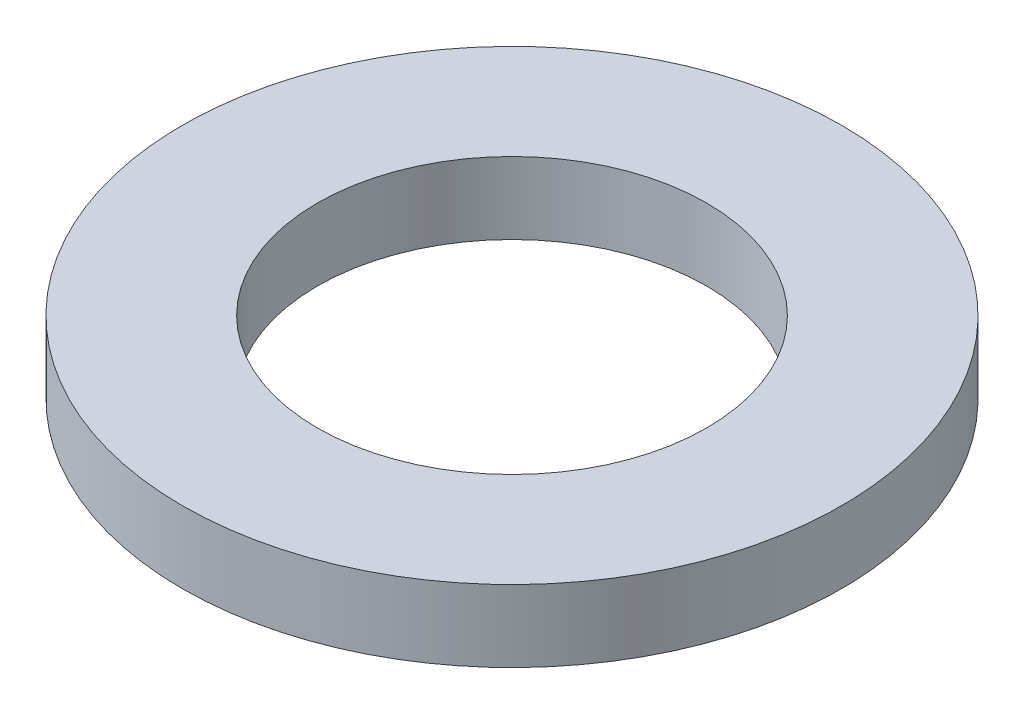
ISO-10303-21;
HEADER;
FILE_DESCRIPTION(('STEP AP214'),'2;1');
FILE_NAME('part.step','',(''),(''),'','','');
FILE_SCHEMA(('AUTOMOTIVE_DESIGN { 1 0 10303 214 1 1 1 1 }'));
ENDSEC;
DATA;
#1=APPLICATION_CONTEXT('core data for automotive mechanical design processes');
#2=APPLICATION_PROTOCOL_DEFINITION('international standard','automotive_design',2000,#1);
#3=PRODUCT_CONTEXT('',#1,'mechanical');
#4=PRODUCT('Part','Part','',(#3));
#5=PRODUCT_RELATED_PRODUCT_CATEGORY('part','',(#4));
#6=PRODUCT_DEFINITION_FORMATION('','',#4);
#7=PRODUCT_DEFINITION_CONTEXT('part definition',#1,'design');
#8=PRODUCT_DEFINITION('design','',#6,#7);
#9=PRODUCT_DEFINITION_SHAPE('','',#8);
#10=(LENGTH_UNIT() NAMED_UNIT(*) SI_UNIT(.MILLI.,.METRE.));
#11=(NAMED_UNIT(*) PLANE_ANGLE_UNIT() SI_UNIT($,.RADIAN.));
#12=(NAMED_UNIT(*) SI_UNIT($,.STERADIAN.) SOLID_ANGLE_UNIT());
#13=UNCERTAINTY_MEASURE_WITH_UNIT(LENGTH_MEASURE(1.E-05),#10,'distance_accuracy_value','');
#14=(GEOMETRIC_REPRESENTATION_CONTEXT(3) GLOBAL_UNCERTAINTY_ASSIGNED_CONTEXT((#13)) GLOBAL_UNIT_ASSIGNED_CONTEXT((#10,
#11,#12)) REPRESENTATION_CONTEXT('',''));
#15=CARTESIAN_POINT('',(0.,0.,0.));
#16=DIRECTION('',(0.,0.,1.));
#17=DIRECTION('',(1.,0.,0.));
#18=AXIS2_PLACEMENT_3D('',#15,#16,#17);
#19=CARTESIAN_POINT('',(0.,12.,0.));
#20=DIRECTION('',(0.,-1.,0.));
#21=DIRECTION('',(0.,0.,-1.));
#22=AXIS2_PLACEMENT_3D('',#19,#20,#21);
#23=CYLINDRICAL_SURFACE('',#22,55.);
#24=CARTESIAN_POINT('',(0.,12.,0.));
#25=DIRECTION('',(0.,1.,0.));
#26=DIRECTION('',(0.,0.,1.));
#27=AXIS2_PLACEMENT_3D('',#24,#25,#26);
#28=CIRCLE('',#27,55.);
#29=CARTESIAN_POINT('',(0.,12.,55.));
#30=VERTEX_POINT('',#29);
#31=EDGE_CURVE('E10',#30,#30,#28,.T.);
#32=ORIENTED_EDGE('',*,*,#31,.F.);
#33=EDGE_LOOP('',(#32));
#34=FACE_BOUND('',#33,.T.);
#35=CARTESIAN_POINT('',(0.,0.,0.));
#36=DIRECTION('',(0.,1.,0.));
#37=DIRECTION('',(0.,0.,1.));
#38=AXIS2_PLACEMENT_3D('',#35,#36,#37);
#39=CIRCLE('',#38,55.);
#40=CARTESIAN_POINT('',(0.,0.,55.));
#41=VERTEX_POINT('',#40);
#42=EDGE_CURVE('E37',#41,#41,#39,.T.);
#43=ORIENTED_EDGE('',*,*,#42,.T.);
#44=EDGE_LOOP('',(#43));
#45=FACE_BOUND('',#44,.T.);
#46=ADVANCED_FACE('F40',(#34,#45),#23,.T.);
#47=CARTESIAN_POINT('',(0.,12.,0.));
#48=DIRECTION('',(0.,1.,0.));
#49=DIRECTION('',(0.,0.,1.));
#50=AXIS2_PLACEMENT_3D('',#47,#48,#49);
#51=PLANE('',#50);
#52=CARTESIAN_POINT('',(0.,12.,0.));
#53=DIRECTION('',(0.,1.,0.));
#54=DIRECTION('',(0.,0.,1.));
#55=AXIS2_PLACEMENT_3D('',#52,#53,#54);
#56=CIRCLE('',#55,32.5);
#57=CARTESIAN_POINT('',(0.,12.,32.5));
#58=VERTEX_POINT('',#57);
#59=EDGE_CURVE('E50',#58,#58,#56,.T.);
#60=ORIENTED_EDGE('',*,*,#59,.F.);
#61=EDGE_LOOP('',(#60));
#62=FACE_BOUND('',#61,.T.);
#63=ORIENTED_EDGE('',*,*,#31,.T.);
#64=EDGE_LOOP('',(#63));
#65=FACE_BOUND('',#64,.T.);
#66=ADVANCED_FACE('F59',(#62,#65),#51,.T.);
#67=CARTESIAN_POINT('',(0.,0.,0.));
#68=DIRECTION('',(0.,1.,0.));
#69=DIRECTION('',(0.,0.,1.));
#70=AXIS2_PLACEMENT_3D('',#67,#68,#69);
#71=PLANE('',#70);
#72=CARTESIAN_POINT('',(0.,0.,0.));
#73=DIRECTION('',(0.,1.,0.));
#74=DIRECTION('',(0.,0.,1.));
#75=AXIS2_PLACEMENT_3D('',#72,#73,#74);
#76=CIRCLE('',#75,32.5);
#77=CARTESIAN_POINT('',(0.,0.,32.5));
#78=VERTEX_POINT('',#77);
#79=EDGE_CURVE('E47',#78,#78,#76,.T.);
#80=ORIENTED_EDGE('',*,*,#79,.T.);
#81=EDGE_LOOP('',(#80));
#82=FACE_BOUND('',#81,.T.);
#83=ORIENTED_EDGE('',*,*,#42,.F.);
#84=EDGE_LOOP('',(#83));
#85=FACE_BOUND('',#84,.T.);
#86=ADVANCED_FACE('F58',(#82,#85),#71,.F.);
#87=CARTESIAN_POINT('',(0.,12.,0.));
#88=DIRECTION('',(0.,-1.,0.));
#89=DIRECTION('',(0.,0.,-1.));
#90=AXIS2_PLACEMENT_3D('',#87,#88,#89);
#91=CYLINDRICAL_SURFACE('',#90,32.5);
#92=ORIENTED_EDGE('',*,*,#59,.T.);
#93=EDGE_LOOP('',(#92));
#94=FACE_BOUND('',#93,.T.);
#95=ORIENTED_EDGE('',*,*,#79,.F.);
#96=EDGE_LOOP('',(#95));
#97=FACE_BOUND('',#96,.T.);
#98=ADVANCED_FACE('F54',(#94,#97),#91,.F.);
#99=CLOSED_SHELL('',(#46,#66,#86,#98));
#100=MANIFOLD_SOLID_BREP('B2',#99);
#101=ADVANCED_BREP_SHAPE_REPRESENTATION('',(#18,#100),#14);
#102=SHAPE_DEFINITION_REPRESENTATION(#9,#101);
ENDSEC;
END-ISO-10303-21;
